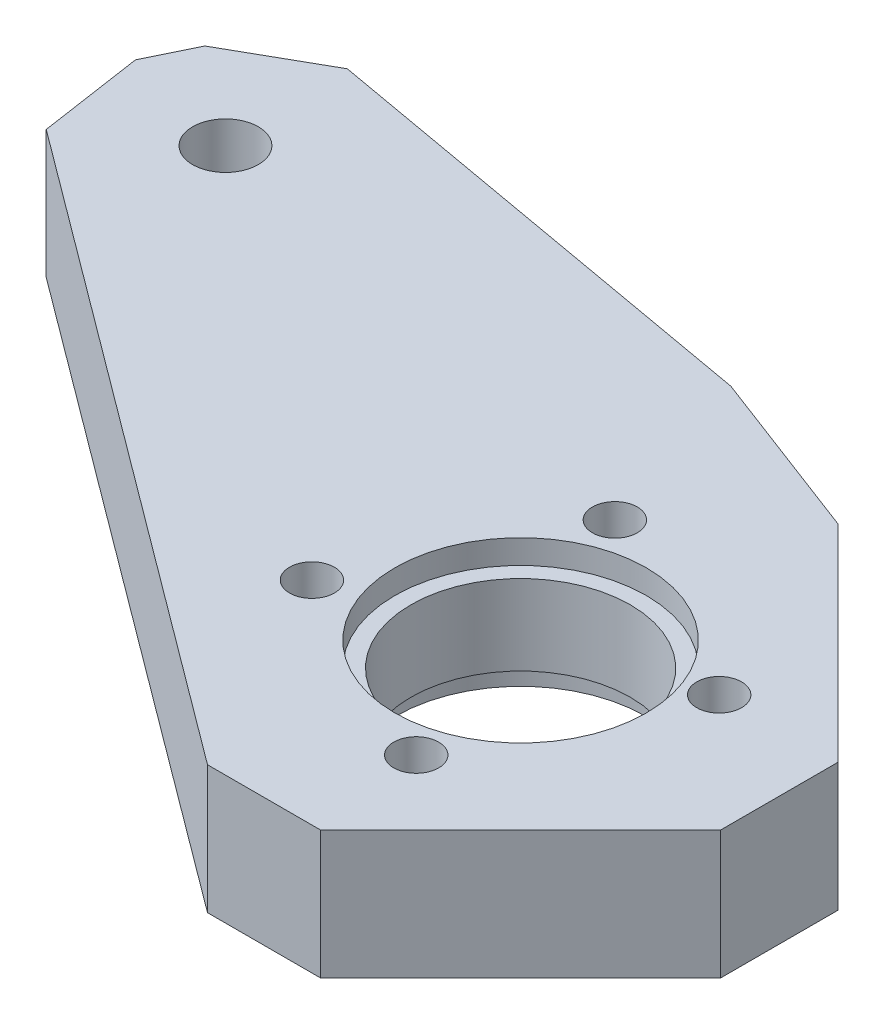
ISO-10303-21;
HEADER;
FILE_DESCRIPTION(('STEP AP214'),'2;1');
FILE_NAME('part.step','',(''),(''),'','','');
FILE_SCHEMA(('AUTOMOTIVE_DESIGN { 1 0 10303 214 1 1 1 1 }'));
ENDSEC;
DATA;
#1=APPLICATION_CONTEXT('core data for automotive mechanical design processes');
#2=APPLICATION_PROTOCOL_DEFINITION('international standard','automotive_design',2000,#1);
#3=PRODUCT_CONTEXT('',#1,'mechanical');
#4=PRODUCT('Part','Part','',(#3));
#5=PRODUCT_RELATED_PRODUCT_CATEGORY('part','',(#4));
#6=PRODUCT_DEFINITION_FORMATION('','',#4);
#7=PRODUCT_DEFINITION_CONTEXT('part definition',#1,'design');
#8=PRODUCT_DEFINITION('design','',#6,#7);
#9=PRODUCT_DEFINITION_SHAPE('','',#8);
#10=(LENGTH_UNIT() NAMED_UNIT(*) SI_UNIT(.MILLI.,.METRE.));
#11=(NAMED_UNIT(*) PLANE_ANGLE_UNIT() SI_UNIT($,.RADIAN.));
#12=(NAMED_UNIT(*) SI_UNIT($,.STERADIAN.) SOLID_ANGLE_UNIT());
#13=UNCERTAINTY_MEASURE_WITH_UNIT(LENGTH_MEASURE(1.E-05),#10,'distance_accuracy_value','');
#14=(GEOMETRIC_REPRESENTATION_CONTEXT(3) GLOBAL_UNCERTAINTY_ASSIGNED_CONTEXT((#13)) GLOBAL_UNIT_ASSIGNED_CONTEXT((#10,
#11,#12)) REPRESENTATION_CONTEXT('',''));
#15=CARTESIAN_POINT('',(0.,0.,0.));
#16=DIRECTION('',(0.,0.,1.));
#17=DIRECTION('',(1.,0.,0.));
#18=AXIS2_PLACEMENT_3D('',#15,#16,#17);
#19=CARTESIAN_POINT('',(-206.266697519,-37.000004703,299.965154128));
#20=DIRECTION('',(0.,-1.,0.));
#21=DIRECTION('',(0.,0.,-1.));
#22=AXIS2_PLACEMENT_3D('',#19,#20,#21);
#23=PLANE('',#22);
#24=CARTESIAN_POINT('',(100.000038384,-37.000004703,62.5));
#25=DIRECTION('',(0.,-1.,0.));
#26=DIRECTION('',(0.,0.,-1.));
#27=AXIS2_PLACEMENT_3D('',#24,#25,#26);
#28=CIRCLE('',#27,6.85);
#29=CARTESIAN_POINT('',(100.000038384,-37.000004703,55.65));
#30=VERTEX_POINT('',#29);
#31=CARTESIAN_POINT('',(93.150038384,-37.000004703,62.5));
#32=VERTEX_POINT('',#31);
#33=EDGE_CURVE('E344',#30,#32,#28,.T.);
#34=ORIENTED_EDGE('',*,*,#33,.T.);
#35=CARTESIAN_POINT('',(100.000038384,-37.000004703,62.5));
#36=DIRECTION('',(0.,-1.,0.));
#37=DIRECTION('',(0.,0.,-1.));
#38=AXIS2_PLACEMENT_3D('',#35,#36,#37);
#39=CIRCLE('',#38,6.85);
#40=EDGE_CURVE('E171',#32,#30,#39,.T.);
#41=ORIENTED_EDGE('',*,*,#40,.T.);
#42=EDGE_LOOP('',(#34,#41));
#43=FACE_BOUND('',#42,.T.);
#44=CARTESIAN_POINT('',(100.000038384,-37.000004703,62.5));
#45=DIRECTION('',(0.,-1.,0.));
#46=DIRECTION('',(0.,0.,-1.));
#47=AXIS2_PLACEMENT_3D('',#44,#45,#46);
#48=CIRCLE('',#47,7.85);
#49=CARTESIAN_POINT('',(92.150038384,-37.000004703,62.5));
#50=VERTEX_POINT('',#49);
#51=CARTESIAN_POINT('',(100.000038384,-37.000004703,54.65));
#52=VERTEX_POINT('',#51);
#53=EDGE_CURVE('E357',#50,#52,#48,.T.);
#54=ORIENTED_EDGE('',*,*,#53,.F.);
#55=CARTESIAN_POINT('',(100.000038384,-37.000004703,62.5));
#56=DIRECTION('',(0.,-1.,0.));
#57=DIRECTION('',(0.,0.,-1.));
#58=AXIS2_PLACEMENT_3D('',#55,#56,#57);
#59=CIRCLE('',#58,7.85);
#60=EDGE_CURVE('E354',#52,#50,#59,.T.);
#61=ORIENTED_EDGE('',*,*,#60,.F.);
#62=EDGE_LOOP('',(#54,#61));
#63=FACE_BOUND('',#62,.T.);
#64=ADVANCED_FACE('F94',(#43,#63),#23,.F.);
#65=CARTESIAN_POINT('',(-206.266697519,-42.000004703,299.965154128));
#66=DIRECTION('',(0.,-1.,0.));
#67=DIRECTION('',(0.,0.,-1.));
#68=AXIS2_PLACEMENT_3D('',#65,#66,#67);
#69=PLANE('',#68);
#70=CARTESIAN_POINT('',(100.000038384,-42.000004703,62.5));
#71=DIRECTION('',(0.,-1.,0.));
#72=DIRECTION('',(0.,0.,-1.));
#73=AXIS2_PLACEMENT_3D('',#70,#71,#72);
#74=CIRCLE('',#73,6.85);
#75=CARTESIAN_POINT('',(93.150038384,-42.000004703,62.5));
#76=VERTEX_POINT('',#75);
#77=CARTESIAN_POINT('',(100.000038384,-42.000004703,55.65));
#78=VERTEX_POINT('',#77);
#79=EDGE_CURVE('E98',#76,#78,#74,.T.);
#80=ORIENTED_EDGE('',*,*,#79,.F.);
#81=CARTESIAN_POINT('',(100.000038384,-42.000004703,62.5));
#82=DIRECTION('',(0.,-1.,0.));
#83=DIRECTION('',(0.,0.,-1.));
#84=AXIS2_PLACEMENT_3D('',#81,#82,#83);
#85=CIRCLE('',#84,6.85);
#86=EDGE_CURVE('E12',#78,#76,#85,.T.);
#87=ORIENTED_EDGE('',*,*,#86,.F.);
#88=EDGE_LOOP('',(#80,#87));
#89=FACE_BOUND('',#88,.T.);
#90=CARTESIAN_POINT('',(100.000038384,-42.000004703,62.5));
#91=DIRECTION('',(0.,-1.,0.));
#92=DIRECTION('',(0.,0.,-1.));
#93=AXIS2_PLACEMENT_3D('',#90,#91,#92);
#94=CIRCLE('',#93,7.8);
#95=CARTESIAN_POINT('',(100.000038384,-42.000004703,54.7));
#96=VERTEX_POINT('',#95);
#97=CARTESIAN_POINT('',(92.200038384,-42.000004703,62.5));
#98=VERTEX_POINT('',#97);
#99=EDGE_CURVE('E366',#96,#98,#94,.T.);
#100=ORIENTED_EDGE('',*,*,#99,.T.);
#101=CARTESIAN_POINT('',(100.000038384,-42.000004703,62.5));
#102=DIRECTION('',(0.,-1.,0.));
#103=DIRECTION('',(0.,0.,-1.));
#104=AXIS2_PLACEMENT_3D('',#101,#102,#103);
#105=CIRCLE('',#104,7.8);
#106=EDGE_CURVE('E364',#98,#96,#105,.T.);
#107=ORIENTED_EDGE('',*,*,#106,.T.);
#108=EDGE_LOOP('',(#100,#107));
#109=FACE_BOUND('',#108,.T.);
#110=ADVANCED_FACE('F454',(#89,#109),#69,.T.);
#111=CARTESIAN_POINT('',(100.000038384,-40.500004703,62.5));
#112=DIRECTION('',(0.,1.,0.));
#113=DIRECTION('',(-1.,0.,0.));
#114=AXIS2_PLACEMENT_3D('',#111,#112,#113);
#115=CYLINDRICAL_SURFACE('',#114,6.85);
#116=DIRECTION('',(0.,-1.,0.));
#117=VECTOR('',#116,1.);
#118=CARTESIAN_POINT('',(93.150038384,-37.000004703,62.5));
#119=LINE('',#118,#117);
#120=EDGE_CURVE('E346',#32,#76,#119,.T.);
#121=ORIENTED_EDGE('',*,*,#120,.F.);
#122=ORIENTED_EDGE('',*,*,#33,.F.);
#123=ORIENTED_EDGE('',*,*,#40,.F.);
#124=ORIENTED_EDGE('',*,*,#120,.T.);
#125=ORIENTED_EDGE('',*,*,#79,.T.);
#126=ORIENTED_EDGE('',*,*,#86,.T.);
#127=EDGE_LOOP('',(#121,#122,#123,#124,#125,#126));
#128=FACE_BOUND('',#127,.T.);
#129=ADVANCED_FACE('F456',(#128),#115,.F.);
#130=CARTESIAN_POINT('',(-206.266697519,-35.500004703,299.965154128));
#131=DIRECTION('',(0.,-1.,0.));
#132=DIRECTION('',(0.,0.,-1.));
#133=AXIS2_PLACEMENT_3D('',#130,#131,#132);
#134=PLANE('',#133);
#135=CARTESIAN_POINT('',(96.429382788,-35.500004703,53.044814244));
#136=DIRECTION('',(0.,-1.,0.));
#137=DIRECTION('',(1.,0.,0.));
#138=AXIS2_PLACEMENT_3D('',#135,#136,#137);
#139=CIRCLE('',#138,1.4);
#140=CARTESIAN_POINT('',(97.829382788,-35.500004703,53.044814244));
#141=VERTEX_POINT('',#140);
#142=CARTESIAN_POINT('',(95.029382788,-35.500004703,53.044814244));
#143=VERTEX_POINT('',#142);
#144=EDGE_CURVE('E350',#141,#143,#139,.T.);
#145=ORIENTED_EDGE('',*,*,#144,.T.);
#146=CARTESIAN_POINT('',(96.429382788,-35.500004703,53.044814244));
#147=DIRECTION('',(0.,-1.,0.));
#148=DIRECTION('',(1.,0.,0.));
#149=AXIS2_PLACEMENT_3D('',#146,#147,#148);
#150=CIRCLE('',#149,1.4);
#151=EDGE_CURVE('E353',#143,#141,#150,.T.);
#152=ORIENTED_EDGE('',*,*,#151,.T.);
#153=EDGE_LOOP('',(#145,#152));
#154=FACE_BOUND('',#153,.T.);
#155=CARTESIAN_POINT('',(102.940745878,-35.500004703,71.955185756));
#156=DIRECTION('',(0.,-1.,0.));
#157=DIRECTION('',(1.,0.,0.));
#158=AXIS2_PLACEMENT_3D('',#155,#156,#157);
#159=CIRCLE('',#158,1.4);
#160=CARTESIAN_POINT('',(104.340745878,-35.500004703,71.955185756));
#161=VERTEX_POINT('',#160);
#162=CARTESIAN_POINT('',(101.540745878,-35.500004703,71.955185756));
#163=VERTEX_POINT('',#162);
#164=EDGE_CURVE('E363',#161,#163,#159,.T.);
#165=ORIENTED_EDGE('',*,*,#164,.T.);
#166=CARTESIAN_POINT('',(102.940745878,-35.500004703,71.955185756));
#167=DIRECTION('',(0.,-1.,0.));
#168=DIRECTION('',(1.,0.,0.));
#169=AXIS2_PLACEMENT_3D('',#166,#167,#168);
#170=CIRCLE('',#169,1.4);
#171=EDGE_CURVE('E420',#163,#161,#170,.T.);
#172=ORIENTED_EDGE('',*,*,#171,.T.);
#173=EDGE_LOOP('',(#165,#172));
#174=FACE_BOUND('',#173,.T.);
#175=CARTESIAN_POINT('',(90.229878577,-35.500004703,65.755681545));
#176=DIRECTION('',(0.,-1.,0.));
#177=DIRECTION('',(1.,0.,0.));
#178=AXIS2_PLACEMENT_3D('',#175,#176,#177);
#179=CIRCLE('',#178,1.4);
#180=CARTESIAN_POINT('',(91.629878577,-35.500004703,65.755681545));
#181=VERTEX_POINT('',#180);
#182=CARTESIAN_POINT('',(88.829878577,-35.500004703,65.755681545));
#183=VERTEX_POINT('',#182);
#184=EDGE_CURVE('E367',#181,#183,#179,.T.);
#185=ORIENTED_EDGE('',*,*,#184,.T.);
#186=CARTESIAN_POINT('',(90.229878577,-35.500004703,65.755681545));
#187=DIRECTION('',(0.,-1.,0.));
#188=DIRECTION('',(1.,0.,0.));
#189=AXIS2_PLACEMENT_3D('',#186,#187,#188);
#190=CIRCLE('',#189,1.4);
#191=EDGE_CURVE('E342',#183,#181,#190,.T.);
#192=ORIENTED_EDGE('',*,*,#191,.T.);
#193=EDGE_LOOP('',(#185,#192));
#194=FACE_BOUND('',#193,.T.);
#195=CARTESIAN_POINT('',(64.046053168,-35.500004703,44.969712702));
#196=DIRECTION('',(0.,-1.,0.));
#197=DIRECTION('',(0.,0.,-1.));
#198=AXIS2_PLACEMENT_3D('',#195,#196,#197);
#199=CIRCLE('',#198,2.05);
#200=CARTESIAN_POINT('',(64.046053168,-35.500004703,42.919712702));
#201=VERTEX_POINT('',#200);
#202=CARTESIAN_POINT('',(61.996053168,-35.500004703,44.969712702));
#203=VERTEX_POINT('',#202);
#204=EDGE_CURVE('E349',#201,#203,#199,.T.);
#205=ORIENTED_EDGE('',*,*,#204,.T.);
#206=CARTESIAN_POINT('',(64.046053168,-35.500004703,44.969712702));
#207=DIRECTION('',(0.,-1.,0.));
#208=DIRECTION('',(0.,0.,-1.));
#209=AXIS2_PLACEMENT_3D('',#206,#207,#208);
#210=CIRCLE('',#209,2.05);
#211=EDGE_CURVE('E375',#203,#201,#210,.T.);
#212=ORIENTED_EDGE('',*,*,#211,.T.);
#213=EDGE_LOOP('',(#205,#212));
#214=FACE_BOUND('',#213,.T.);
#215=CARTESIAN_POINT('',(109.140250089,-35.500004703,59.244318455));
#216=DIRECTION('',(0.,-1.,0.));
#217=DIRECTION('',(1.,0.,0.));
#218=AXIS2_PLACEMENT_3D('',#215,#216,#217);
#219=CIRCLE('',#218,1.4);
#220=CARTESIAN_POINT('',(110.540250089,-35.500004703,59.244318455));
#221=VERTEX_POINT('',#220);
#222=CARTESIAN_POINT('',(107.740250089,-35.500004703,59.244318455));
#223=VERTEX_POINT('',#222);
#224=EDGE_CURVE('E387',#221,#223,#219,.T.);
#225=ORIENTED_EDGE('',*,*,#224,.T.);
#226=CARTESIAN_POINT('',(109.140250089,-35.500004703,59.244318455));
#227=DIRECTION('',(0.,-1.,0.));
#228=DIRECTION('',(1.,0.,0.));
#229=AXIS2_PLACEMENT_3D('',#226,#227,#228);
#230=CIRCLE('',#229,1.4);
#231=EDGE_CURVE('E389',#223,#221,#230,.T.);
#232=ORIENTED_EDGE('',*,*,#231,.T.);
#233=EDGE_LOOP('',(#225,#232));
#234=FACE_BOUND('',#233,.T.);
#235=CARTESIAN_POINT('',(100.000038384,-35.500004703,62.5));
#236=DIRECTION('',(0.,-1.,0.));
#237=DIRECTION('',(0.,0.,-1.));
#238=AXIS2_PLACEMENT_3D('',#235,#236,#237);
#239=CIRCLE('',#238,7.85);
#240=CARTESIAN_POINT('',(100.000038384,-35.500004703,54.65));
#241=VERTEX_POINT('',#240);
#242=CARTESIAN_POINT('',(92.150038384,-35.500004703,62.5));
#243=VERTEX_POINT('',#242);
#244=EDGE_CURVE('E371',#241,#243,#239,.T.);
#245=ORIENTED_EDGE('',*,*,#244,.T.);
#246=CARTESIAN_POINT('',(100.000038384,-35.500004703,62.5));
#247=DIRECTION('',(0.,-1.,0.));
#248=DIRECTION('',(0.,0.,-1.));
#249=AXIS2_PLACEMENT_3D('',#246,#247,#248);
#250=CIRCLE('',#249,7.85);
#251=EDGE_CURVE('E360',#243,#241,#250,.T.);
#252=ORIENTED_EDGE('',*,*,#251,.T.);
#253=EDGE_LOOP('',(#245,#252));
#254=FACE_BOUND('',#253,.T.);
#255=DIRECTION('',(-0.870211440463982,0.,0.492678443698931));
#256=VECTOR('',#255,1.);
#257=CARTESIAN_POINT('',(63.6897348581457,-35.500004703,37.0094723415916));
#258=LINE('',#257,#256);
#259=CARTESIAN_POINT('',(63.6897348581457,-35.500004703,37.0094723415916));
#260=VERTEX_POINT('',#259);
#261=CARTESIAN_POINT('',(58.0177872912911,-35.500004703,40.2206991423907));
#262=VERTEX_POINT('',#261);
#263=EDGE_CURVE('E286',#260,#262,#258,.T.);
#264=ORIENTED_EDGE('',*,*,#263,.T.);
#265=DIRECTION('',(-0.438371147077342,0.,0.898794046158571));
#266=VECTOR('',#265,1.);
#267=CARTESIAN_POINT('',(58.0177872912911,-35.500004703,40.2206991423907));
#268=LINE('',#267,#266);
#269=CARTESIAN_POINT('',(56.5968550797981,-35.500004703,43.134041911867));
#270=VERTEX_POINT('',#269);
#271=EDGE_CURVE('E503',#262,#270,#268,.T.);
#272=ORIENTED_EDGE('',*,*,#271,.T.);
#273=DIRECTION('',(0.147519747511098,0.,0.989059110515778));
#274=VECTOR('',#273,1.);
#275=CARTESIAN_POINT('',(56.5968550797981,-35.500004703,43.134041911867));
#276=LINE('',#275,#274);
#277=CARTESIAN_POINT('',(57.5738866518634,-35.500004703,49.6846359436255));
#278=VERTEX_POINT('',#277);
#279=EDGE_CURVE('E282',#270,#278,#276,.T.);
#280=ORIENTED_EDGE('',*,*,#279,.T.);
#281=DIRECTION('',(0.802173464510192,0.,0.597091059082043));
#282=VECTOR('',#281,1.);
#283=CARTESIAN_POINT('',(57.5738866518634,-35.500004703,49.6846359436255));
#284=LINE('',#283,#282);
#285=CARTESIAN_POINT('',(96.9523845078725,-35.500004703,78.995689014));
#286=VERTEX_POINT('',#285);
#287=EDGE_CURVE('E508',#278,#286,#284,.T.);
#288=ORIENTED_EDGE('',*,*,#287,.T.);
#289=DIRECTION('',(1.,0.,0.));
#290=VECTOR('',#289,1.);
#291=CARTESIAN_POINT('',(96.9523845078725,-35.500004703,78.995689014));
#292=LINE('',#291,#290);
#293=CARTESIAN_POINT('',(104.010446024746,-35.500004703,78.995689014));
#294=VERTEX_POINT('',#293);
#295=EDGE_CURVE('E513',#286,#294,#292,.T.);
#296=ORIENTED_EDGE('',*,*,#295,.T.);
#297=DIRECTION('',(0.707106781186548,0.,-0.707106781186548));
#298=VECTOR('',#297,1.);
#299=CARTESIAN_POINT('',(104.010446024746,-35.500004703,78.995689014));
#300=LINE('',#299,#298);
#301=CARTESIAN_POINT('',(116.495727399,-35.500004703,66.5104076397462));
#302=VERTEX_POINT('',#301);
#303=EDGE_CURVE('E516',#294,#302,#300,.T.);
#304=ORIENTED_EDGE('',*,*,#303,.T.);
#305=DIRECTION('',(0.,0.,-1.));
#306=VECTOR('',#305,1.);
#307=CARTESIAN_POINT('',(116.495727399,-35.500004703,66.5104076397462));
#308=LINE('',#307,#306);
#309=CARTESIAN_POINT('',(116.495727399,-35.500004703,59.1966991412538));
#310=VERTEX_POINT('',#309);
#311=EDGE_CURVE('E519',#302,#310,#308,.T.);
#312=ORIENTED_EDGE('',*,*,#311,.T.);
#313=DIRECTION('',(-0.707106781186548,0.,-0.707106781186547));
#314=VECTOR('',#313,1.);
#315=CARTESIAN_POINT('',(116.495727399,-35.500004703,59.1966991412538));
#316=LINE('',#315,#314);
#317=CARTESIAN_POINT('',(103.586027530498,-35.500004703,46.2869992727514));
#318=VERTEX_POINT('',#317);
#319=EDGE_CURVE('E522',#310,#318,#316,.T.);
#320=ORIENTED_EDGE('',*,*,#319,.T.);
#321=DIRECTION('',(-0.934785835128812,0.,-0.35521182756565));
#322=VECTOR('',#321,1.);
#323=CARTESIAN_POINT('',(103.586027530498,-35.500004703,46.2869992727514));
#324=LINE('',#323,#322);
#325=CARTESIAN_POINT('',(92.822153420475,-35.500004703,42.1968052939553));
#326=VERTEX_POINT('',#325);
#327=EDGE_CURVE('E525',#318,#326,#324,.T.);
#328=ORIENTED_EDGE('',*,*,#327,.T.);
#329=DIRECTION('',(-0.984514503788386,0.,-0.17530314267094));
#330=VECTOR('',#329,1.);
#331=CARTESIAN_POINT('',(92.822153420475,-35.500004703,42.1968052939553));
#332=LINE('',#331,#330);
#333=EDGE_CURVE('E397',#326,#260,#332,.T.);
#334=ORIENTED_EDGE('',*,*,#333,.T.);
#335=EDGE_LOOP('',(#264,#272,#280,#288,#296,#304,#312,#320,#328,#334));
#336=FACE_BOUND('',#335,.T.);
#337=ADVANCED_FACE('F431',(#154,#174,#194,#214,#234,#254,#336),#134,.F.);
#338=CARTESIAN_POINT('',(-206.266697519,-43.500004703,299.965154128));
#339=DIRECTION('',(0.,-1.,0.));
#340=DIRECTION('',(0.,0.,-1.));
#341=AXIS2_PLACEMENT_3D('',#338,#339,#340);
#342=PLANE('',#341);
#343=CARTESIAN_POINT('',(96.429382788,-43.500004703,53.044814244));
#344=DIRECTION('',(0.,-1.,0.));
#345=DIRECTION('',(0.,0.,-1.));
#346=AXIS2_PLACEMENT_3D('',#343,#344,#345);
#347=CIRCLE('',#346,1.4);
#348=CARTESIAN_POINT('',(95.029382788,-43.500004703,53.044814244));
#349=VERTEX_POINT('',#348);
#350=CARTESIAN_POINT('',(96.429382788,-43.500004703,51.644814244));
#351=VERTEX_POINT('',#350);
#352=EDGE_CURVE('E386',#349,#351,#347,.T.);
#353=ORIENTED_EDGE('',*,*,#352,.F.);
#354=CARTESIAN_POINT('',(96.429382788,-43.500004703,53.044814244));
#355=DIRECTION('',(0.,-1.,0.));
#356=DIRECTION('',(0.,0.,-1.));
#357=AXIS2_PLACEMENT_3D('',#354,#355,#356);
#358=CIRCLE('',#357,1.4);
#359=EDGE_CURVE('E398',#351,#349,#358,.T.);
#360=ORIENTED_EDGE('',*,*,#359,.F.);
#361=EDGE_LOOP('',(#353,#360));
#362=FACE_BOUND('',#361,.T.);
#363=CARTESIAN_POINT('',(102.940745878,-43.500004703,71.955185756));
#364=DIRECTION('',(0.,-1.,0.));
#365=DIRECTION('',(0.,0.,-1.));
#366=AXIS2_PLACEMENT_3D('',#363,#364,#365);
#367=CIRCLE('',#366,1.4);
#368=CARTESIAN_POINT('',(101.540745878,-43.500004703,71.955185756));
#369=VERTEX_POINT('',#368);
#370=CARTESIAN_POINT('',(102.940745878,-43.500004703,70.555185756));
#371=VERTEX_POINT('',#370);
#372=EDGE_CURVE('E410',#369,#371,#367,.T.);
#373=ORIENTED_EDGE('',*,*,#372,.F.);
#374=CARTESIAN_POINT('',(102.940745878,-43.500004703,71.955185756));
#375=DIRECTION('',(0.,-1.,0.));
#376=DIRECTION('',(0.,0.,-1.));
#377=AXIS2_PLACEMENT_3D('',#374,#375,#376);
#378=CIRCLE('',#377,1.4);
#379=EDGE_CURVE('E384',#371,#369,#378,.T.);
#380=ORIENTED_EDGE('',*,*,#379,.F.);
#381=EDGE_LOOP('',(#373,#380));
#382=FACE_BOUND('',#381,.T.);
#383=CARTESIAN_POINT('',(90.229878577,-43.500004703,65.755681545));
#384=DIRECTION('',(0.,-1.,0.));
#385=DIRECTION('',(0.,0.,-1.));
#386=AXIS2_PLACEMENT_3D('',#383,#384,#385);
#387=CIRCLE('',#386,1.4);
#388=CARTESIAN_POINT('',(88.829878577,-43.500004703,65.755681545));
#389=VERTEX_POINT('',#388);
#390=CARTESIAN_POINT('',(90.229878577,-43.500004703,64.355681545));
#391=VERTEX_POINT('',#390);
#392=EDGE_CURVE('E334',#389,#391,#387,.T.);
#393=ORIENTED_EDGE('',*,*,#392,.F.);
#394=CARTESIAN_POINT('',(90.229878577,-43.500004703,65.755681545));
#395=DIRECTION('',(0.,-1.,0.));
#396=DIRECTION('',(0.,0.,-1.));
#397=AXIS2_PLACEMENT_3D('',#394,#395,#396);
#398=CIRCLE('',#397,1.4);
#399=EDGE_CURVE('E331',#391,#389,#398,.T.);
#400=ORIENTED_EDGE('',*,*,#399,.F.);
#401=EDGE_LOOP('',(#393,#400));
#402=FACE_BOUND('',#401,.T.);
#403=CARTESIAN_POINT('',(64.046053168,-43.500004703,44.969712702));
#404=DIRECTION('',(0.,-1.,0.));
#405=DIRECTION('',(0.,0.,-1.));
#406=AXIS2_PLACEMENT_3D('',#403,#404,#405);
#407=CIRCLE('',#406,2.05);
#408=CARTESIAN_POINT('',(61.996053168,-43.500004703,44.969712702));
#409=VERTEX_POINT('',#408);
#410=CARTESIAN_POINT('',(64.046053168,-43.500004703,42.919712702));
#411=VERTEX_POINT('',#410);
#412=EDGE_CURVE('E377',#409,#411,#407,.T.);
#413=ORIENTED_EDGE('',*,*,#412,.F.);
#414=CARTESIAN_POINT('',(64.046053168,-43.500004703,44.969712702));
#415=DIRECTION('',(0.,-1.,0.));
#416=DIRECTION('',(0.,0.,-1.));
#417=AXIS2_PLACEMENT_3D('',#414,#415,#416);
#418=CIRCLE('',#417,2.05);
#419=EDGE_CURVE('E394',#411,#409,#418,.T.);
#420=ORIENTED_EDGE('',*,*,#419,.F.);
#421=EDGE_LOOP('',(#413,#420));
#422=FACE_BOUND('',#421,.T.);
#423=CARTESIAN_POINT('',(109.140250089,-43.500004703,59.244318455));
#424=DIRECTION('',(0.,-1.,0.));
#425=DIRECTION('',(0.,0.,-1.));
#426=AXIS2_PLACEMENT_3D('',#423,#424,#425);
#427=CIRCLE('',#426,1.4);
#428=CARTESIAN_POINT('',(107.740250089,-43.500004703,59.244318455));
#429=VERTEX_POINT('',#428);
#430=CARTESIAN_POINT('',(109.140250089,-43.500004703,57.844318455));
#431=VERTEX_POINT('',#430);
#432=EDGE_CURVE('E403',#429,#431,#427,.T.);
#433=ORIENTED_EDGE('',*,*,#432,.F.);
#434=CARTESIAN_POINT('',(109.140250089,-43.500004703,59.244318455));
#435=DIRECTION('',(0.,-1.,0.));
#436=DIRECTION('',(0.,0.,-1.));
#437=AXIS2_PLACEMENT_3D('',#434,#435,#436);
#438=CIRCLE('',#437,1.4);
#439=EDGE_CURVE('E381',#431,#429,#438,.T.);
#440=ORIENTED_EDGE('',*,*,#439,.F.);
#441=EDGE_LOOP('',(#433,#440));
#442=FACE_BOUND('',#441,.T.);
#443=CARTESIAN_POINT('',(100.000038384,-43.500004703,62.5));
#444=DIRECTION('',(0.,-1.,0.));
#445=DIRECTION('',(0.,0.,-1.));
#446=AXIS2_PLACEMENT_3D('',#443,#444,#445);
#447=CIRCLE('',#446,7.8);
#448=CARTESIAN_POINT('',(92.200038384,-43.500004703,62.5));
#449=VERTEX_POINT('',#448);
#450=CARTESIAN_POINT('',(100.000038384,-43.500004703,54.7));
#451=VERTEX_POINT('',#450);
#452=EDGE_CURVE('E339',#449,#451,#447,.T.);
#453=ORIENTED_EDGE('',*,*,#452,.F.);
#454=CARTESIAN_POINT('',(100.000038384,-43.500004703,62.5));
#455=DIRECTION('',(0.,-1.,0.));
#456=DIRECTION('',(0.,0.,-1.));
#457=AXIS2_PLACEMENT_3D('',#454,#455,#456);
#458=CIRCLE('',#457,7.8);
#459=EDGE_CURVE('E335',#451,#449,#458,.T.);
#460=ORIENTED_EDGE('',*,*,#459,.F.);
#461=EDGE_LOOP('',(#453,#460));
#462=FACE_BOUND('',#461,.T.);
#463=DIRECTION('',(-0.870211440463982,0.,0.492678443698932));
#464=VECTOR('',#463,1.);
#465=CARTESIAN_POINT('',(63.6897348581457,-43.500004703,37.0094723415916));
#466=LINE('',#465,#464);
#467=CARTESIAN_POINT('',(63.6897348581457,-43.500004703,37.0094723415916));
#468=VERTEX_POINT('',#467);
#469=CARTESIAN_POINT('',(58.0177872912911,-43.500004703,40.2206991423907));
#470=VERTEX_POINT('',#469);
#471=EDGE_CURVE('E296',#468,#470,#466,.T.);
#472=ORIENTED_EDGE('',*,*,#471,.F.);
#473=DIRECTION('',(-0.984514503788386,0.,-0.17530314267094));
#474=VECTOR('',#473,1.);
#475=CARTESIAN_POINT('',(92.822153420475,-43.500004703,42.1968052939553));
#476=LINE('',#475,#474);
#477=CARTESIAN_POINT('',(92.822153420475,-43.500004703,42.1968052939553));
#478=VERTEX_POINT('',#477);
#479=EDGE_CURVE('E298',#478,#468,#476,.T.);
#480=ORIENTED_EDGE('',*,*,#479,.F.);
#481=DIRECTION('',(-0.934785835128812,0.,-0.35521182756565));
#482=VECTOR('',#481,1.);
#483=CARTESIAN_POINT('',(103.586027530498,-43.500004703,46.2869992727514));
#484=LINE('',#483,#482);
#485=CARTESIAN_POINT('',(103.586027530498,-43.500004703,46.2869992727514));
#486=VERTEX_POINT('',#485);
#487=EDGE_CURVE('E302',#486,#478,#484,.T.);
#488=ORIENTED_EDGE('',*,*,#487,.F.);
#489=DIRECTION('',(-0.707106781186548,0.,-0.707106781186547));
#490=VECTOR('',#489,1.);
#491=CARTESIAN_POINT('',(116.495727399,-43.500004703,59.1966991412538));
#492=LINE('',#491,#490);
#493=CARTESIAN_POINT('',(116.495727399,-43.500004703,59.1966991412538));
#494=VERTEX_POINT('',#493);
#495=EDGE_CURVE('E306',#494,#486,#492,.T.);
#496=ORIENTED_EDGE('',*,*,#495,.F.);
#497=DIRECTION('',(0.,0.,-1.));
#498=VECTOR('',#497,1.);
#499=CARTESIAN_POINT('',(116.495727399,-43.500004703,66.5104076397462));
#500=LINE('',#499,#498);
#501=CARTESIAN_POINT('',(116.495727399,-43.500004703,66.5104076397462));
#502=VERTEX_POINT('',#501);
#503=EDGE_CURVE('E310',#502,#494,#500,.T.);
#504=ORIENTED_EDGE('',*,*,#503,.F.);
#505=DIRECTION('',(0.707106781186548,0.,-0.707106781186548));
#506=VECTOR('',#505,1.);
#507=CARTESIAN_POINT('',(104.010446024746,-43.500004703,78.995689014));
#508=LINE('',#507,#506);
#509=CARTESIAN_POINT('',(104.010446024746,-43.500004703,78.995689014));
#510=VERTEX_POINT('',#509);
#511=EDGE_CURVE('E314',#510,#502,#508,.T.);
#512=ORIENTED_EDGE('',*,*,#511,.F.);
#513=DIRECTION('',(1.,0.,0.));
#514=VECTOR('',#513,1.);
#515=CARTESIAN_POINT('',(96.9523845078725,-43.500004703,78.995689014));
#516=LINE('',#515,#514);
#517=CARTESIAN_POINT('',(96.9523845078725,-43.500004703,78.995689014));
#518=VERTEX_POINT('',#517);
#519=EDGE_CURVE('E318',#518,#510,#516,.T.);
#520=ORIENTED_EDGE('',*,*,#519,.F.);
#521=DIRECTION('',(0.802173464510192,0.,0.597091059082043));
#522=VECTOR('',#521,1.);
#523=CARTESIAN_POINT('',(57.5738866518634,-43.500004703,49.6846359436255));
#524=LINE('',#523,#522);
#525=CARTESIAN_POINT('',(57.5738866518634,-43.500004703,49.6846359436255));
#526=VERTEX_POINT('',#525);
#527=EDGE_CURVE('E272',#526,#518,#524,.T.);
#528=ORIENTED_EDGE('',*,*,#527,.F.);
#529=DIRECTION('',(0.147519747511098,0.,0.989059110515778));
#530=VECTOR('',#529,1.);
#531=CARTESIAN_POINT('',(56.5968550797981,-43.500004703,43.134041911867));
#532=LINE('',#531,#530);
#533=CARTESIAN_POINT('',(56.5968550797981,-43.500004703,43.134041911867));
#534=VERTEX_POINT('',#533);
#535=EDGE_CURVE('E265',#534,#526,#532,.T.);
#536=ORIENTED_EDGE('',*,*,#535,.F.);
#537=DIRECTION('',(-0.438371147077342,0.,0.898794046158571));
#538=VECTOR('',#537,1.);
#539=CARTESIAN_POINT('',(58.0177872912911,-43.500004703,40.2206991423907));
#540=LINE('',#539,#538);
#541=EDGE_CURVE('E269',#470,#534,#540,.T.);
#542=ORIENTED_EDGE('',*,*,#541,.F.);
#543=EDGE_LOOP('',(#472,#480,#488,#496,#504,#512,#520,#528,#536,#542));
#544=FACE_BOUND('',#543,.T.);
#545=ADVANCED_FACE('F267',(#362,#382,#402,#422,#442,#462,#544),#342,.T.);
#546=CARTESIAN_POINT('',(96.429382788,-41.500004703,53.044814244));
#547=DIRECTION('',(0.,1.,0.));
#548=DIRECTION('',(-1.,0.,0.));
#549=AXIS2_PLACEMENT_3D('',#546,#547,#548);
#550=CYLINDRICAL_SURFACE('',#549,1.4);
#551=DIRECTION('',(0.,-1.,0.));
#552=VECTOR('',#551,1.);
#553=CARTESIAN_POINT('',(95.029382788,-35.500004703,53.044814244));
#554=LINE('',#553,#552);
#555=EDGE_CURVE('E338',#143,#349,#554,.T.);
#556=ORIENTED_EDGE('',*,*,#555,.F.);
#557=ORIENTED_EDGE('',*,*,#144,.F.);
#558=ORIENTED_EDGE('',*,*,#151,.F.);
#559=ORIENTED_EDGE('',*,*,#555,.T.);
#560=ORIENTED_EDGE('',*,*,#352,.T.);
#561=ORIENTED_EDGE('',*,*,#359,.T.);
#562=EDGE_LOOP('',(#556,#557,#558,#559,#560,#561));
#563=FACE_BOUND('',#562,.T.);
#564=ADVANCED_FACE('F439',(#563),#550,.F.);
#565=CARTESIAN_POINT('',(100.000038384,-41.500004703,62.5));
#566=DIRECTION('',(0.,1.,0.));
#567=DIRECTION('',(-1.,0.,0.));
#568=AXIS2_PLACEMENT_3D('',#565,#566,#567);
#569=CYLINDRICAL_SURFACE('',#568,7.8);
#570=DIRECTION('',(0.,-1.,0.));
#571=VECTOR('',#570,1.);
#572=CARTESIAN_POINT('',(92.200038384,-42.000004703,62.5));
#573=LINE('',#572,#571);
#574=EDGE_CURVE('E378',#98,#449,#573,.T.);
#575=ORIENTED_EDGE('',*,*,#574,.F.);
#576=ORIENTED_EDGE('',*,*,#99,.F.);
#577=ORIENTED_EDGE('',*,*,#106,.F.);
#578=ORIENTED_EDGE('',*,*,#574,.T.);
#579=ORIENTED_EDGE('',*,*,#452,.T.);
#580=ORIENTED_EDGE('',*,*,#459,.T.);
#581=EDGE_LOOP('',(#575,#576,#577,#578,#579,#580));
#582=FACE_BOUND('',#581,.T.);
#583=ADVANCED_FACE('F451',(#582),#569,.F.);
#584=CARTESIAN_POINT('',(109.140250089,-41.500004703,59.244318455));
#585=DIRECTION('',(0.,1.,0.));
#586=DIRECTION('',(-1.,0.,0.));
#587=AXIS2_PLACEMENT_3D('',#584,#585,#586);
#588=CYLINDRICAL_SURFACE('',#587,1.4);
#589=DIRECTION('',(0.,-1.,0.));
#590=VECTOR('',#589,1.);
#591=CARTESIAN_POINT('',(107.740250089,-35.500004703,59.244318455));
#592=LINE('',#591,#590);
#593=EDGE_CURVE('E390',#223,#429,#592,.T.);
#594=ORIENTED_EDGE('',*,*,#593,.F.);
#595=ORIENTED_EDGE('',*,*,#224,.F.);
#596=ORIENTED_EDGE('',*,*,#231,.F.);
#597=ORIENTED_EDGE('',*,*,#593,.T.);
#598=ORIENTED_EDGE('',*,*,#432,.T.);
#599=ORIENTED_EDGE('',*,*,#439,.T.);
#600=EDGE_LOOP('',(#594,#595,#596,#597,#598,#599));
#601=FACE_BOUND('',#600,.T.);
#602=ADVANCED_FACE('F468',(#601),#588,.F.);
#603=CARTESIAN_POINT('',(64.046053168,-41.500004703,44.969712702));
#604=DIRECTION('',(0.,1.,0.));
#605=DIRECTION('',(-1.,0.,0.));
#606=AXIS2_PLACEMENT_3D('',#603,#604,#605);
#607=CYLINDRICAL_SURFACE('',#606,2.05);
#608=DIRECTION('',(0.,-1.,0.));
#609=VECTOR('',#608,1.);
#610=CARTESIAN_POINT('',(61.996053168,-35.500004703,44.969712702));
#611=LINE('',#610,#609);
#612=EDGE_CURVE('E333',#203,#409,#611,.T.);
#613=ORIENTED_EDGE('',*,*,#612,.F.);
#614=ORIENTED_EDGE('',*,*,#204,.F.);
#615=ORIENTED_EDGE('',*,*,#211,.F.);
#616=ORIENTED_EDGE('',*,*,#612,.T.);
#617=ORIENTED_EDGE('',*,*,#412,.T.);
#618=ORIENTED_EDGE('',*,*,#419,.T.);
#619=EDGE_LOOP('',(#613,#614,#615,#616,#617,#618));
#620=FACE_BOUND('',#619,.T.);
#621=ADVANCED_FACE('F96',(#620),#607,.F.);
#622=CARTESIAN_POINT('',(90.229878577,-41.500004703,65.755681545));
#623=DIRECTION('',(0.,1.,0.));
#624=DIRECTION('',(-1.,0.,0.));
#625=AXIS2_PLACEMENT_3D('',#622,#623,#624);
#626=CYLINDRICAL_SURFACE('',#625,1.4);
#627=DIRECTION('',(0.,-1.,0.));
#628=VECTOR('',#627,1.);
#629=CARTESIAN_POINT('',(88.829878577,-35.500004703,65.755681545));
#630=LINE('',#629,#628);
#631=EDGE_CURVE('E370',#183,#389,#630,.T.);
#632=ORIENTED_EDGE('',*,*,#631,.F.);
#633=ORIENTED_EDGE('',*,*,#184,.F.);
#634=ORIENTED_EDGE('',*,*,#191,.F.);
#635=ORIENTED_EDGE('',*,*,#631,.T.);
#636=ORIENTED_EDGE('',*,*,#392,.T.);
#637=ORIENTED_EDGE('',*,*,#399,.T.);
#638=EDGE_LOOP('',(#632,#633,#634,#635,#636,#637));
#639=FACE_BOUND('',#638,.T.);
#640=ADVANCED_FACE('F476',(#639),#626,.F.);
#641=CARTESIAN_POINT('',(102.940745878,-41.500004703,71.955185756));
#642=DIRECTION('',(0.,1.,0.));
#643=DIRECTION('',(-1.,0.,0.));
#644=AXIS2_PLACEMENT_3D('',#641,#642,#643);
#645=CYLINDRICAL_SURFACE('',#644,1.4);
#646=DIRECTION('',(0.,-1.,0.));
#647=VECTOR('',#646,1.);
#648=CARTESIAN_POINT('',(101.540745878,-35.500004703,71.955185756));
#649=LINE('',#648,#647);
#650=EDGE_CURVE('E356',#163,#369,#649,.T.);
#651=ORIENTED_EDGE('',*,*,#650,.F.);
#652=ORIENTED_EDGE('',*,*,#164,.F.);
#653=ORIENTED_EDGE('',*,*,#171,.F.);
#654=ORIENTED_EDGE('',*,*,#650,.T.);
#655=ORIENTED_EDGE('',*,*,#372,.T.);
#656=ORIENTED_EDGE('',*,*,#379,.T.);
#657=EDGE_LOOP('',(#651,#652,#653,#654,#655,#656));
#658=FACE_BOUND('',#657,.T.);
#659=ADVANCED_FACE('F434',(#658),#645,.F.);
#660=CARTESIAN_POINT('',(100.000038384,-41.500004703,62.5));
#661=DIRECTION('',(0.,1.,0.));
#662=DIRECTION('',(-1.,0.,0.));
#663=AXIS2_PLACEMENT_3D('',#660,#661,#662);
#664=CYLINDRICAL_SURFACE('',#663,7.85);
#665=DIRECTION('',(0.,-1.,0.));
#666=VECTOR('',#665,1.);
#667=CARTESIAN_POINT('',(92.150038384,-35.500004703,62.5));
#668=LINE('',#667,#666);
#669=EDGE_CURVE('E374',#243,#50,#668,.T.);
#670=ORIENTED_EDGE('',*,*,#669,.F.);
#671=ORIENTED_EDGE('',*,*,#244,.F.);
#672=ORIENTED_EDGE('',*,*,#251,.F.);
#673=ORIENTED_EDGE('',*,*,#669,.T.);
#674=ORIENTED_EDGE('',*,*,#53,.T.);
#675=ORIENTED_EDGE('',*,*,#60,.T.);
#676=EDGE_LOOP('',(#670,#671,#672,#673,#674,#675));
#677=FACE_BOUND('',#676,.T.);
#678=ADVANCED_FACE('F472',(#677),#664,.F.);
#679=CARTESIAN_POINT('',(63.6897348581457,-116.6486020619,37.0094723415916));
#680=DIRECTION('',(-0.492678443698932,0.,-0.870211440463982));
#681=DIRECTION('',(-0.870211440463982,0.,0.492678443698932));
#682=AXIS2_PLACEMENT_3D('',#679,#680,#681);
#683=PLANE('',#682);
#684=DIRECTION('',(0.,1.,0.));
#685=VECTOR('',#684,1.);
#686=CARTESIAN_POINT('',(63.6897348581457,-116.6486020619,37.0094723415916));
#687=LINE('',#686,#685);
#688=EDGE_CURVE('E301',#468,#260,#687,.T.);
#689=ORIENTED_EDGE('',*,*,#688,.F.);
#690=ORIENTED_EDGE('',*,*,#471,.T.);
#691=DIRECTION('',(0.,1.,0.));
#692=VECTOR('',#691,1.);
#693=CARTESIAN_POINT('',(58.0177872912911,-116.6486020619,40.2206991423907));
#694=LINE('',#693,#692);
#695=EDGE_CURVE('E290',#470,#262,#694,.T.);
#696=ORIENTED_EDGE('',*,*,#695,.T.);
#697=ORIENTED_EDGE('',*,*,#263,.F.);
#698=EDGE_LOOP('',(#689,#690,#696,#697));
#699=FACE_BOUND('',#698,.T.);
#700=ADVANCED_FACE('F474',(#699),#683,.T.);
#701=CARTESIAN_POINT('',(92.822153420475,-116.6486020619,42.1968052939553));
#702=DIRECTION('',(0.17530314267094,0.,-0.984514503788386));
#703=DIRECTION('',(-0.984514503788386,0.,-0.17530314267094));
#704=AXIS2_PLACEMENT_3D('',#701,#702,#703);
#705=PLANE('',#704);
#706=DIRECTION('',(0.,1.,0.));
#707=VECTOR('',#706,1.);
#708=CARTESIAN_POINT('',(92.822153420475,-116.6486020619,42.1968052939553));
#709=LINE('',#708,#707);
#710=EDGE_CURVE('E305',#478,#326,#709,.T.);
#711=ORIENTED_EDGE('',*,*,#710,.F.);
#712=ORIENTED_EDGE('',*,*,#479,.T.);
#713=ORIENTED_EDGE('',*,*,#688,.T.);
#714=ORIENTED_EDGE('',*,*,#333,.F.);
#715=EDGE_LOOP('',(#711,#712,#713,#714));
#716=FACE_BOUND('',#715,.T.);
#717=ADVANCED_FACE('F533',(#716),#705,.T.);
#718=CARTESIAN_POINT('',(103.586027530498,-116.6486020619,46.2869992727514));
#719=DIRECTION('',(0.35521182756565,0.,-0.934785835128812));
#720=DIRECTION('',(-0.934785835128812,0.,-0.35521182756565));
#721=AXIS2_PLACEMENT_3D('',#718,#719,#720);
#722=PLANE('',#721);
#723=DIRECTION('',(0.,1.,0.));
#724=VECTOR('',#723,1.);
#725=CARTESIAN_POINT('',(103.586027530498,-116.6486020619,46.2869992727514));
#726=LINE('',#725,#724);
#727=EDGE_CURVE('E309',#486,#318,#726,.T.);
#728=ORIENTED_EDGE('',*,*,#727,.F.);
#729=ORIENTED_EDGE('',*,*,#487,.T.);
#730=ORIENTED_EDGE('',*,*,#710,.T.);
#731=ORIENTED_EDGE('',*,*,#327,.F.);
#732=EDGE_LOOP('',(#728,#729,#730,#731));
#733=FACE_BOUND('',#732,.T.);
#734=ADVANCED_FACE('F535',(#733),#722,.T.);
#735=CARTESIAN_POINT('',(116.495727399,-116.6486020619,59.1966991412538));
#736=DIRECTION('',(0.707106781186547,0.,-0.707106781186548));
#737=DIRECTION('',(-0.707106781186548,0.,-0.707106781186547));
#738=AXIS2_PLACEMENT_3D('',#735,#736,#737);
#739=PLANE('',#738);
#740=DIRECTION('',(0.,1.,0.));
#741=VECTOR('',#740,1.);
#742=CARTESIAN_POINT('',(116.495727399,-116.6486020619,59.1966991412538));
#743=LINE('',#742,#741);
#744=EDGE_CURVE('E313',#494,#310,#743,.T.);
#745=ORIENTED_EDGE('',*,*,#744,.F.);
#746=ORIENTED_EDGE('',*,*,#495,.T.);
#747=ORIENTED_EDGE('',*,*,#727,.T.);
#748=ORIENTED_EDGE('',*,*,#319,.F.);
#749=EDGE_LOOP('',(#745,#746,#747,#748));
#750=FACE_BOUND('',#749,.T.);
#751=ADVANCED_FACE('F537',(#750),#739,.T.);
#752=CARTESIAN_POINT('',(116.495727399,-116.6486020619,66.5104076397462));
#753=DIRECTION('',(1.,0.,0.));
#754=DIRECTION('',(0.,0.,-1.));
#755=AXIS2_PLACEMENT_3D('',#752,#753,#754);
#756=PLANE('',#755);
#757=DIRECTION('',(0.,1.,0.));
#758=VECTOR('',#757,1.);
#759=CARTESIAN_POINT('',(116.495727399,-116.6486020619,66.5104076397462));
#760=LINE('',#759,#758);
#761=EDGE_CURVE('E317',#502,#302,#760,.T.);
#762=ORIENTED_EDGE('',*,*,#761,.F.);
#763=ORIENTED_EDGE('',*,*,#503,.T.);
#764=ORIENTED_EDGE('',*,*,#744,.T.);
#765=ORIENTED_EDGE('',*,*,#311,.F.);
#766=EDGE_LOOP('',(#762,#763,#764,#765));
#767=FACE_BOUND('',#766,.T.);
#768=ADVANCED_FACE('F541',(#767),#756,.T.);
#769=CARTESIAN_POINT('',(104.010446024746,-116.6486020619,78.995689014));
#770=DIRECTION('',(0.707106781186547,0.,0.707106781186547));
#771=DIRECTION('',(0.707106781186548,0.,-0.707106781186548));
#772=AXIS2_PLACEMENT_3D('',#769,#770,#771);
#773=PLANE('',#772);
#774=DIRECTION('',(0.,1.,0.));
#775=VECTOR('',#774,1.);
#776=CARTESIAN_POINT('',(104.010446024746,-116.6486020619,78.995689014));
#777=LINE('',#776,#775);
#778=EDGE_CURVE('E321',#510,#294,#777,.T.);
#779=ORIENTED_EDGE('',*,*,#778,.F.);
#780=ORIENTED_EDGE('',*,*,#511,.T.);
#781=ORIENTED_EDGE('',*,*,#761,.T.);
#782=ORIENTED_EDGE('',*,*,#303,.F.);
#783=EDGE_LOOP('',(#779,#780,#781,#782));
#784=FACE_BOUND('',#783,.T.);
#785=ADVANCED_FACE('F546',(#784),#773,.T.);
#786=CARTESIAN_POINT('',(96.9523845078725,-116.6486020619,78.995689014));
#787=DIRECTION('',(0.,0.,1.));
#788=DIRECTION('',(1.,0.,0.));
#789=AXIS2_PLACEMENT_3D('',#786,#787,#788);
#790=PLANE('',#789);
#791=DIRECTION('',(0.,1.,0.));
#792=VECTOR('',#791,1.);
#793=CARTESIAN_POINT('',(96.9523845078725,-116.6486020619,78.995689014));
#794=LINE('',#793,#792);
#795=EDGE_CURVE('E276',#518,#286,#794,.T.);
#796=ORIENTED_EDGE('',*,*,#795,.F.);
#797=ORIENTED_EDGE('',*,*,#519,.T.);
#798=ORIENTED_EDGE('',*,*,#778,.T.);
#799=ORIENTED_EDGE('',*,*,#295,.F.);
#800=EDGE_LOOP('',(#796,#797,#798,#799));
#801=FACE_BOUND('',#800,.T.);
#802=ADVANCED_FACE('F549',(#801),#790,.T.);
#803=CARTESIAN_POINT('',(57.5738866518634,-116.6486020619,49.6846359436255));
#804=DIRECTION('',(-0.597091059082043,0.,0.802173464510192));
#805=DIRECTION('',(0.802173464510192,0.,0.597091059082043));
#806=AXIS2_PLACEMENT_3D('',#803,#804,#805);
#807=PLANE('',#806);
#808=DIRECTION('',(0.,1.,0.));
#809=VECTOR('',#808,1.);
#810=CARTESIAN_POINT('',(57.5738866518634,-116.6486020619,49.6846359436255));
#811=LINE('',#810,#809);
#812=EDGE_CURVE('E275',#526,#278,#811,.T.);
#813=ORIENTED_EDGE('',*,*,#812,.F.);
#814=ORIENTED_EDGE('',*,*,#527,.T.);
#815=ORIENTED_EDGE('',*,*,#795,.T.);
#816=ORIENTED_EDGE('',*,*,#287,.F.);
#817=EDGE_LOOP('',(#813,#814,#815,#816));
#818=FACE_BOUND('',#817,.T.);
#819=ADVANCED_FACE('F552',(#818),#807,.T.);
#820=CARTESIAN_POINT('',(56.5968550797981,-116.6486020619,43.134041911867));
#821=DIRECTION('',(-0.989059110515778,0.,0.147519747511098));
#822=DIRECTION('',(0.147519747511098,0.,0.989059110515778));
#823=AXIS2_PLACEMENT_3D('',#820,#821,#822);
#824=PLANE('',#823);
#825=DIRECTION('',(0.,1.,0.));
#826=VECTOR('',#825,1.);
#827=CARTESIAN_POINT('',(56.5968550797981,-116.6486020619,43.134041911867));
#828=LINE('',#827,#826);
#829=EDGE_CURVE('E279',#534,#270,#828,.T.);
#830=ORIENTED_EDGE('',*,*,#829,.F.);
#831=ORIENTED_EDGE('',*,*,#535,.T.);
#832=ORIENTED_EDGE('',*,*,#812,.T.);
#833=ORIENTED_EDGE('',*,*,#279,.F.);
#834=EDGE_LOOP('',(#830,#831,#832,#833));
#835=FACE_BOUND('',#834,.T.);
#836=ADVANCED_FACE('F280',(#835),#824,.T.);
#837=CARTESIAN_POINT('',(58.0177872912911,-116.6486020619,40.2206991423907));
#838=DIRECTION('',(-0.898794046158571,0.,-0.438371147077342));
#839=DIRECTION('',(-0.438371147077342,0.,0.898794046158571));
#840=AXIS2_PLACEMENT_3D('',#837,#838,#839);
#841=PLANE('',#840);
#842=ORIENTED_EDGE('',*,*,#695,.F.);
#843=ORIENTED_EDGE('',*,*,#541,.T.);
#844=ORIENTED_EDGE('',*,*,#829,.T.);
#845=ORIENTED_EDGE('',*,*,#271,.F.);
#846=EDGE_LOOP('',(#842,#843,#844,#845));
#847=FACE_BOUND('',#846,.T.);
#848=ADVANCED_FACE('F289',(#847),#841,.T.);
#849=CLOSED_SHELL('',(#64,#110,#129,#337,#545,#564,#583,#602,#621,#640,#659,#678,#700,#717,#734,
#751,#768,#785,#802,#819,#836,#848));
#850=MANIFOLD_SOLID_BREP('B2',#849);
#851=ADVANCED_BREP_SHAPE_REPRESENTATION('',(#18,#850),#14);
#852=SHAPE_DEFINITION_REPRESENTATION(#9,#851);
ENDSEC;
END-ISO-10303-21;
